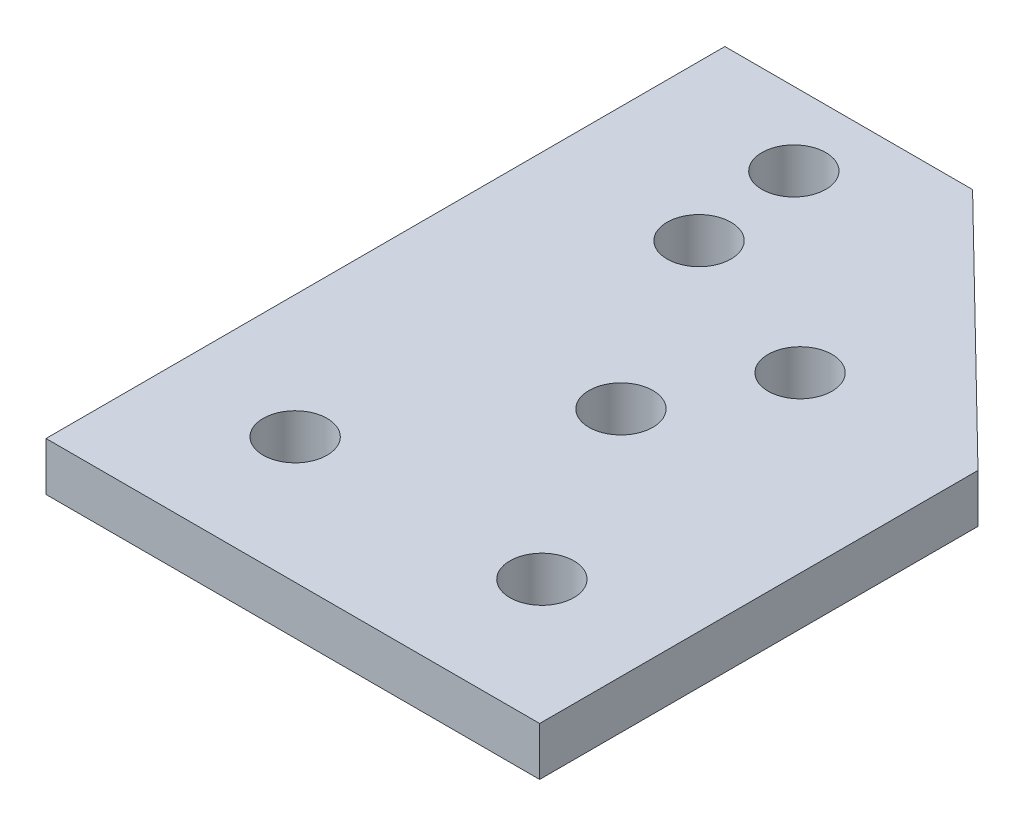
ISO-10303-21;
HEADER;
FILE_DESCRIPTION(('STEP AP214'),'2;1');
FILE_NAME('part.step','',(''),(''),'','','');
FILE_SCHEMA(('AUTOMOTIVE_DESIGN { 1 0 10303 214 1 1 1 1 }'));
ENDSEC;
DATA;
#1=APPLICATION_CONTEXT('core data for automotive mechanical design processes');
#2=APPLICATION_PROTOCOL_DEFINITION('international standard','automotive_design',2000,#1);
#3=PRODUCT_CONTEXT('',#1,'mechanical');
#4=PRODUCT('Part','Part','',(#3));
#5=PRODUCT_RELATED_PRODUCT_CATEGORY('part','',(#4));
#6=PRODUCT_DEFINITION_FORMATION('','',#4);
#7=PRODUCT_DEFINITION_CONTEXT('part definition',#1,'design');
#8=PRODUCT_DEFINITION('design','',#6,#7);
#9=PRODUCT_DEFINITION_SHAPE('','',#8);
#10=(LENGTH_UNIT() NAMED_UNIT(*) SI_UNIT(.MILLI.,.METRE.));
#11=(NAMED_UNIT(*) PLANE_ANGLE_UNIT() SI_UNIT($,.RADIAN.));
#12=(NAMED_UNIT(*) SI_UNIT($,.STERADIAN.) SOLID_ANGLE_UNIT());
#13=UNCERTAINTY_MEASURE_WITH_UNIT(LENGTH_MEASURE(1.E-05),#10,'distance_accuracy_value','');
#14=(GEOMETRIC_REPRESENTATION_CONTEXT(3) GLOBAL_UNCERTAINTY_ASSIGNED_CONTEXT((#13)) GLOBAL_UNIT_ASSIGNED_CONTEXT((#10,
#11,#12)) REPRESENTATION_CONTEXT('',''));
#15=CARTESIAN_POINT('',(0.,0.,0.));
#16=DIRECTION('',(0.,0.,1.));
#17=DIRECTION('',(1.,0.,0.));
#18=AXIS2_PLACEMENT_3D('',#15,#16,#17);
#19=CARTESIAN_POINT('',(0.,5.,0.));
#20=DIRECTION('',(0.,0.,1.));
#21=DIRECTION('',(1.,0.,0.));
#22=AXIS2_PLACEMENT_3D('',#19,#20,#21);
#23=PLANE('',#22);
#24=DIRECTION('',(-1.,0.,0.));
#25=VECTOR('',#24,1.);
#26=CARTESIAN_POINT('',(0.,0.,0.));
#27=LINE('',#26,#25);
#28=CARTESIAN_POINT('',(50.9,0.,0.));
#29=VERTEX_POINT('',#28);
#30=CARTESIAN_POINT('',(0.,0.,0.));
#31=VERTEX_POINT('',#30);
#32=EDGE_CURVE('E125',#29,#31,#27,.T.);
#33=ORIENTED_EDGE('',*,*,#32,.F.);
#34=DIRECTION('',(0.,-1.,0.));
#35=VECTOR('',#34,1.);
#36=CARTESIAN_POINT('',(50.9,5.,0.));
#37=LINE('',#36,#35);
#38=CARTESIAN_POINT('',(50.9,5.,0.));
#39=VERTEX_POINT('',#38);
#40=EDGE_CURVE('E11',#39,#29,#37,.T.);
#41=ORIENTED_EDGE('',*,*,#40,.F.);
#42=DIRECTION('',(-1.,0.,0.));
#43=VECTOR('',#42,1.);
#44=CARTESIAN_POINT('',(0.,5.,0.));
#45=LINE('',#44,#43);
#46=CARTESIAN_POINT('',(0.,5.,0.));
#47=VERTEX_POINT('',#46);
#48=EDGE_CURVE('E296',#39,#47,#45,.T.);
#49=ORIENTED_EDGE('',*,*,#48,.T.);
#50=DIRECTION('',(0.,-1.,0.));
#51=VECTOR('',#50,1.);
#52=CARTESIAN_POINT('',(0.,5.,0.));
#53=LINE('',#52,#51);
#54=EDGE_CURVE('E50',#47,#31,#53,.T.);
#55=ORIENTED_EDGE('',*,*,#54,.T.);
#56=EDGE_LOOP('',(#33,#41,#49,#55));
#57=FACE_BOUND('',#56,.T.);
#58=ADVANCED_FACE('F33',(#57),#23,.T.);
#59=CARTESIAN_POINT('',(50.9,5.,0.));
#60=DIRECTION('',(1.,0.,0.));
#61=DIRECTION('',(0.,0.,-1.));
#62=AXIS2_PLACEMENT_3D('',#59,#60,#61);
#63=PLANE('',#62);
#64=DIRECTION('',(0.,0.,1.));
#65=VECTOR('',#64,1.);
#66=CARTESIAN_POINT('',(50.9,0.,0.));
#67=LINE('',#66,#65);
#68=CARTESIAN_POINT('',(50.9,0.,-45.2));
#69=VERTEX_POINT('',#68);
#70=EDGE_CURVE('E127',#69,#29,#67,.T.);
#71=ORIENTED_EDGE('',*,*,#70,.F.);
#72=DIRECTION('',(0.,-1.,0.));
#73=VECTOR('',#72,1.);
#74=CARTESIAN_POINT('',(50.9,5.,-45.2));
#75=LINE('',#74,#73);
#76=CARTESIAN_POINT('',(50.9,5.,-45.2));
#77=VERTEX_POINT('',#76);
#78=EDGE_CURVE('E42',#77,#69,#75,.T.);
#79=ORIENTED_EDGE('',*,*,#78,.F.);
#80=DIRECTION('',(0.,0.,1.));
#81=VECTOR('',#80,1.);
#82=CARTESIAN_POINT('',(50.9,5.,0.));
#83=LINE('',#82,#81);
#84=EDGE_CURVE('E99',#77,#39,#83,.T.);
#85=ORIENTED_EDGE('',*,*,#84,.T.);
#86=ORIENTED_EDGE('',*,*,#40,.T.);
#87=EDGE_LOOP('',(#71,#79,#85,#86));
#88=FACE_BOUND('',#87,.T.);
#89=ADVANCED_FACE('F140',(#88),#63,.T.);
#90=CARTESIAN_POINT('',(47.4761761848323,5.,-48.5482188728769));
#91=DIRECTION('',(0.699168875902642,0.,-0.714956560197217));
#92=DIRECTION('',(-0.714956560197217,0.,-0.699168875902642));
#93=AXIS2_PLACEMENT_3D('',#90,#91,#92);
#94=PLANE('',#93);
#95=DIRECTION('',(0.714956560197217,0.,0.699168875902642));
#96=VECTOR('',#95,1.);
#97=CARTESIAN_POINT('',(47.4761761848323,0.,-48.5482188728769));
#98=LINE('',#97,#96);
#99=CARTESIAN_POINT('',(25.54,0.,-70.));
#100=VERTEX_POINT('',#99);
#101=EDGE_CURVE('E87',#100,#69,#98,.T.);
#102=ORIENTED_EDGE('',*,*,#101,.F.);
#103=DIRECTION('',(0.,-1.,0.));
#104=VECTOR('',#103,1.);
#105=CARTESIAN_POINT('',(25.54,5.,-70.));
#106=LINE('',#105,#104);
#107=CARTESIAN_POINT('',(25.54,5.,-70.));
#108=VERTEX_POINT('',#107);
#109=EDGE_CURVE('E82',#108,#100,#106,.T.);
#110=ORIENTED_EDGE('',*,*,#109,.F.);
#111=DIRECTION('',(0.714956560197217,0.,0.699168875902642));
#112=VECTOR('',#111,1.);
#113=CARTESIAN_POINT('',(47.4761761848323,5.,-48.5482188728769));
#114=LINE('',#113,#112);
#115=EDGE_CURVE('E85',#108,#77,#114,.T.);
#116=ORIENTED_EDGE('',*,*,#115,.T.);
#117=ORIENTED_EDGE('',*,*,#78,.T.);
#118=EDGE_LOOP('',(#102,#110,#116,#117));
#119=FACE_BOUND('',#118,.T.);
#120=ADVANCED_FACE('F84',(#119),#94,.T.);
#121=CARTESIAN_POINT('',(0.,5.,-70.));
#122=DIRECTION('',(0.,0.,-1.));
#123=DIRECTION('',(-1.,0.,0.));
#124=AXIS2_PLACEMENT_3D('',#121,#122,#123);
#125=PLANE('',#124);
#126=DIRECTION('',(1.,0.,0.));
#127=VECTOR('',#126,1.);
#128=CARTESIAN_POINT('',(0.,0.,-70.));
#129=LINE('',#128,#127);
#130=CARTESIAN_POINT('',(0.,0.,-70.));
#131=VERTEX_POINT('',#130);
#132=EDGE_CURVE('E131',#131,#100,#129,.T.);
#133=ORIENTED_EDGE('',*,*,#132,.F.);
#134=DIRECTION('',(0.,-1.,0.));
#135=VECTOR('',#134,1.);
#136=CARTESIAN_POINT('',(0.,5.,-70.));
#137=LINE('',#136,#135);
#138=CARTESIAN_POINT('',(0.,5.,-70.));
#139=VERTEX_POINT('',#138);
#140=EDGE_CURVE('E66',#139,#131,#137,.T.);
#141=ORIENTED_EDGE('',*,*,#140,.F.);
#142=DIRECTION('',(1.,0.,0.));
#143=VECTOR('',#142,1.);
#144=CARTESIAN_POINT('',(0.,5.,-70.));
#145=LINE('',#144,#143);
#146=EDGE_CURVE('E97',#139,#108,#145,.T.);
#147=ORIENTED_EDGE('',*,*,#146,.T.);
#148=ORIENTED_EDGE('',*,*,#109,.T.);
#149=EDGE_LOOP('',(#133,#141,#147,#148));
#150=FACE_BOUND('',#149,.T.);
#151=ADVANCED_FACE('F101',(#150),#125,.T.);
#152=CARTESIAN_POINT('',(14.6674832347224,5.,-62.445));
#153=DIRECTION('',(0.,-1.,0.));
#154=DIRECTION('',(0.,0.,-1.));
#155=AXIS2_PLACEMENT_3D('',#152,#153,#154);
#156=CYLINDRICAL_SURFACE('',#155,3.295);
#157=CARTESIAN_POINT('',(14.6674832347224,5.,-62.445));
#158=DIRECTION('',(0.,1.,0.));
#159=DIRECTION('',(0.,0.,1.));
#160=AXIS2_PLACEMENT_3D('',#157,#158,#159);
#161=CIRCLE('',#160,3.295);
#162=CARTESIAN_POINT('',(14.6674832347224,5.,-59.15));
#163=VERTEX_POINT('',#162);
#164=EDGE_CURVE('E293',#163,#163,#161,.T.);
#165=ORIENTED_EDGE('',*,*,#164,.T.);
#166=EDGE_LOOP('',(#165));
#167=FACE_BOUND('',#166,.T.);
#168=CARTESIAN_POINT('',(14.6674832347224,0.,-62.445));
#169=DIRECTION('',(0.,1.,0.));
#170=DIRECTION('',(0.,0.,1.));
#171=AXIS2_PLACEMENT_3D('',#168,#169,#170);
#172=CIRCLE('',#171,3.295);
#173=CARTESIAN_POINT('',(14.6674832347224,0.,-59.15));
#174=VERTEX_POINT('',#173);
#175=EDGE_CURVE('E122',#174,#174,#172,.T.);
#176=ORIENTED_EDGE('',*,*,#175,.F.);
#177=EDGE_LOOP('',(#176));
#178=FACE_BOUND('',#177,.T.);
#179=ADVANCED_FACE('F164',(#167,#178),#156,.F.);
#180=CARTESIAN_POINT('',(33.0089447644355,5.,-44.7438449824862));
#181=DIRECTION('',(0.,-1.,0.));
#182=DIRECTION('',(0.,0.,-1.));
#183=AXIS2_PLACEMENT_3D('',#180,#181,#182);
#184=CYLINDRICAL_SURFACE('',#183,3.295);
#185=CARTESIAN_POINT('',(33.0089447644355,5.,-44.7438449824862));
#186=DIRECTION('',(0.,1.,0.));
#187=DIRECTION('',(0.,0.,1.));
#188=AXIS2_PLACEMENT_3D('',#185,#186,#187);
#189=CIRCLE('',#188,3.295);
#190=CARTESIAN_POINT('',(33.0089447644355,5.,-41.4488449824862));
#191=VERTEX_POINT('',#190);
#192=EDGE_CURVE('E290',#191,#191,#189,.T.);
#193=ORIENTED_EDGE('',*,*,#192,.T.);
#194=EDGE_LOOP('',(#193));
#195=FACE_BOUND('',#194,.T.);
#196=CARTESIAN_POINT('',(33.0089447644355,0.,-44.7438449824862));
#197=DIRECTION('',(0.,1.,0.));
#198=DIRECTION('',(0.,0.,1.));
#199=AXIS2_PLACEMENT_3D('',#196,#197,#198);
#200=CIRCLE('',#199,3.295);
#201=CARTESIAN_POINT('',(33.0089447644355,0.,-41.4488449824862));
#202=VERTEX_POINT('',#201);
#203=EDGE_CURVE('E119',#202,#202,#200,.T.);
#204=ORIENTED_EDGE('',*,*,#203,.F.);
#205=EDGE_LOOP('',(#204));
#206=FACE_BOUND('',#205,.T.);
#207=ADVANCED_FACE('F167',(#195,#206),#184,.F.);
#208=CARTESIAN_POINT('',(12.695,5.,-12.995));
#209=DIRECTION('',(0.,-1.,0.));
#210=DIRECTION('',(0.,0.,-1.));
#211=AXIS2_PLACEMENT_3D('',#208,#209,#210);
#212=CYLINDRICAL_SURFACE('',#211,3.295);
#213=CARTESIAN_POINT('',(12.695,5.,-12.995));
#214=DIRECTION('',(0.,1.,0.));
#215=DIRECTION('',(0.,0.,1.));
#216=AXIS2_PLACEMENT_3D('',#213,#214,#215);
#217=CIRCLE('',#216,3.295);
#218=CARTESIAN_POINT('',(12.695,5.,-9.69999999999999));
#219=VERTEX_POINT('',#218);
#220=EDGE_CURVE('E283',#219,#219,#217,.T.);
#221=ORIENTED_EDGE('',*,*,#220,.T.);
#222=EDGE_LOOP('',(#221));
#223=FACE_BOUND('',#222,.T.);
#224=CARTESIAN_POINT('',(12.695,0.,-12.995));
#225=DIRECTION('',(0.,1.,0.));
#226=DIRECTION('',(0.,0.,1.));
#227=AXIS2_PLACEMENT_3D('',#224,#225,#226);
#228=CIRCLE('',#227,3.295);
#229=CARTESIAN_POINT('',(12.695,0.,-9.69999999999999));
#230=VERTEX_POINT('',#229);
#231=EDGE_CURVE('E116',#230,#230,#228,.T.);
#232=ORIENTED_EDGE('',*,*,#231,.F.);
#233=EDGE_LOOP('',(#232));
#234=FACE_BOUND('',#233,.T.);
#235=ADVANCED_FACE('F171',(#223,#234),#212,.F.);
#236=CARTESIAN_POINT('',(38.135,5.,-12.995));
#237=DIRECTION('',(0.,-1.,0.));
#238=DIRECTION('',(0.,0.,-1.));
#239=AXIS2_PLACEMENT_3D('',#236,#237,#238);
#240=CYLINDRICAL_SURFACE('',#239,3.295);
#241=CARTESIAN_POINT('',(38.135,5.,-12.995));
#242=DIRECTION('',(0.,1.,0.));
#243=DIRECTION('',(0.,0.,1.));
#244=AXIS2_PLACEMENT_3D('',#241,#242,#243);
#245=CIRCLE('',#244,3.295);
#246=CARTESIAN_POINT('',(38.135,5.,-9.69999999999999));
#247=VERTEX_POINT('',#246);
#248=EDGE_CURVE('E280',#247,#247,#245,.T.);
#249=ORIENTED_EDGE('',*,*,#248,.T.);
#250=EDGE_LOOP('',(#249));
#251=FACE_BOUND('',#250,.T.);
#252=CARTESIAN_POINT('',(38.135,0.,-12.995));
#253=DIRECTION('',(0.,1.,0.));
#254=DIRECTION('',(0.,0.,1.));
#255=AXIS2_PLACEMENT_3D('',#252,#253,#254);
#256=CIRCLE('',#255,3.295);
#257=CARTESIAN_POINT('',(38.135,0.,-9.69999999999999));
#258=VERTEX_POINT('',#257);
#259=EDGE_CURVE('E113',#258,#258,#256,.T.);
#260=ORIENTED_EDGE('',*,*,#259,.F.);
#261=EDGE_LOOP('',(#260));
#262=FACE_BOUND('',#261,.T.);
#263=ADVANCED_FACE('F175',(#251,#262),#240,.F.);
#264=CARTESIAN_POINT('',(16.,5.,-51.3339446255367));
#265=DIRECTION('',(0.,-1.,0.));
#266=DIRECTION('',(0.,0.,-1.));
#267=AXIS2_PLACEMENT_3D('',#264,#265,#266);
#268=CYLINDRICAL_SURFACE('',#267,3.29499999999999);
#269=CARTESIAN_POINT('',(16.,5.,-51.3339446255367));
#270=DIRECTION('',(0.,1.,0.));
#271=DIRECTION('',(0.,0.,1.));
#272=AXIS2_PLACEMENT_3D('',#269,#270,#271);
#273=CIRCLE('',#272,3.29499999999999);
#274=CARTESIAN_POINT('',(16.,5.,-48.0389446255367));
#275=VERTEX_POINT('',#274);
#276=EDGE_CURVE('E186',#275,#275,#273,.T.);
#277=ORIENTED_EDGE('',*,*,#276,.T.);
#278=EDGE_LOOP('',(#277));
#279=FACE_BOUND('',#278,.T.);
#280=CARTESIAN_POINT('',(16.,0.,-51.3339446255367));
#281=DIRECTION('',(0.,1.,0.));
#282=DIRECTION('',(0.,0.,1.));
#283=AXIS2_PLACEMENT_3D('',#280,#281,#282);
#284=CIRCLE('',#283,3.29499999999999);
#285=CARTESIAN_POINT('',(16.,0.,-48.0389446255367));
#286=VERTEX_POINT('',#285);
#287=EDGE_CURVE('E110',#286,#286,#284,.T.);
#288=ORIENTED_EDGE('',*,*,#287,.F.);
#289=EDGE_LOOP('',(#288));
#290=FACE_BOUND('',#289,.T.);
#291=ADVANCED_FACE('F152',(#279,#290),#268,.F.);
#292=CARTESIAN_POINT('',(27.,5.,-32.2813857422792));
#293=DIRECTION('',(0.,-1.,0.));
#294=DIRECTION('',(0.,0.,-1.));
#295=AXIS2_PLACEMENT_3D('',#292,#293,#294);
#296=CYLINDRICAL_SURFACE('',#295,3.29499999999997);
#297=CARTESIAN_POINT('',(27.,5.,-32.2813857422792));
#298=DIRECTION('',(0.,1.,0.));
#299=DIRECTION('',(0.,0.,1.));
#300=AXIS2_PLACEMENT_3D('',#297,#298,#299);
#301=CIRCLE('',#300,3.29499999999997);
#302=CARTESIAN_POINT('',(27.,5.,-28.9863857422793));
#303=VERTEX_POINT('',#302);
#304=EDGE_CURVE('E136',#303,#303,#301,.T.);
#305=ORIENTED_EDGE('',*,*,#304,.T.);
#306=EDGE_LOOP('',(#305));
#307=FACE_BOUND('',#306,.T.);
#308=CARTESIAN_POINT('',(27.,0.,-32.2813857422792));
#309=DIRECTION('',(0.,1.,0.));
#310=DIRECTION('',(0.,0.,1.));
#311=AXIS2_PLACEMENT_3D('',#308,#309,#310);
#312=CIRCLE('',#311,3.29499999999997);
#313=CARTESIAN_POINT('',(27.,0.,-28.9863857422793));
#314=VERTEX_POINT('',#313);
#315=EDGE_CURVE('E107',#314,#314,#312,.T.);
#316=ORIENTED_EDGE('',*,*,#315,.F.);
#317=EDGE_LOOP('',(#316));
#318=FACE_BOUND('',#317,.T.);
#319=ADVANCED_FACE('F35',(#307,#318),#296,.F.);
#320=CARTESIAN_POINT('',(0.,5.,0.));
#321=DIRECTION('',(-1.,0.,0.));
#322=DIRECTION('',(0.,0.,1.));
#323=AXIS2_PLACEMENT_3D('',#320,#321,#322);
#324=PLANE('',#323);
#325=DIRECTION('',(0.,0.,-1.));
#326=VECTOR('',#325,1.);
#327=CARTESIAN_POINT('',(0.,0.,0.));
#328=LINE('',#327,#326);
#329=EDGE_CURVE('E133',#31,#131,#328,.T.);
#330=ORIENTED_EDGE('',*,*,#329,.F.);
#331=ORIENTED_EDGE('',*,*,#54,.F.);
#332=DIRECTION('',(0.,0.,-1.));
#333=VECTOR('',#332,1.);
#334=CARTESIAN_POINT('',(0.,5.,0.));
#335=LINE('',#334,#333);
#336=EDGE_CURVE('E102',#47,#139,#335,.T.);
#337=ORIENTED_EDGE('',*,*,#336,.T.);
#338=ORIENTED_EDGE('',*,*,#140,.T.);
#339=EDGE_LOOP('',(#330,#331,#337,#338));
#340=FACE_BOUND('',#339,.T.);
#341=ADVANCED_FACE('F143',(#340),#324,.T.);
#342=CARTESIAN_POINT('',(0.,5.,0.));
#343=DIRECTION('',(0.,1.,0.));
#344=DIRECTION('',(0.,0.,1.));
#345=AXIS2_PLACEMENT_3D('',#342,#343,#344);
#346=PLANE('',#345);
#347=ORIENTED_EDGE('',*,*,#304,.F.);
#348=EDGE_LOOP('',(#347));
#349=FACE_BOUND('',#348,.T.);
#350=ORIENTED_EDGE('',*,*,#276,.F.);
#351=EDGE_LOOP('',(#350));
#352=FACE_BOUND('',#351,.T.);
#353=ORIENTED_EDGE('',*,*,#248,.F.);
#354=EDGE_LOOP('',(#353));
#355=FACE_BOUND('',#354,.T.);
#356=ORIENTED_EDGE('',*,*,#220,.F.);
#357=EDGE_LOOP('',(#356));
#358=FACE_BOUND('',#357,.T.);
#359=ORIENTED_EDGE('',*,*,#192,.F.);
#360=EDGE_LOOP('',(#359));
#361=FACE_BOUND('',#360,.T.);
#362=ORIENTED_EDGE('',*,*,#164,.F.);
#363=EDGE_LOOP('',(#362));
#364=FACE_BOUND('',#363,.T.);
#365=ORIENTED_EDGE('',*,*,#48,.F.);
#366=ORIENTED_EDGE('',*,*,#84,.F.);
#367=ORIENTED_EDGE('',*,*,#115,.F.);
#368=ORIENTED_EDGE('',*,*,#146,.F.);
#369=ORIENTED_EDGE('',*,*,#336,.F.);
#370=EDGE_LOOP('',(#365,#366,#367,#368,#369));
#371=FACE_BOUND('',#370,.T.);
#372=ADVANCED_FACE('F95',(#349,#352,#355,#358,#361,#364,#371),#346,.T.);
#373=CARTESIAN_POINT('',(0.,0.,0.));
#374=DIRECTION('',(0.,1.,0.));
#375=DIRECTION('',(0.,0.,1.));
#376=AXIS2_PLACEMENT_3D('',#373,#374,#375);
#377=PLANE('',#376);
#378=ORIENTED_EDGE('',*,*,#315,.T.);
#379=EDGE_LOOP('',(#378));
#380=FACE_BOUND('',#379,.T.);
#381=ORIENTED_EDGE('',*,*,#287,.T.);
#382=EDGE_LOOP('',(#381));
#383=FACE_BOUND('',#382,.T.);
#384=ORIENTED_EDGE('',*,*,#259,.T.);
#385=EDGE_LOOP('',(#384));
#386=FACE_BOUND('',#385,.T.);
#387=ORIENTED_EDGE('',*,*,#231,.T.);
#388=EDGE_LOOP('',(#387));
#389=FACE_BOUND('',#388,.T.);
#390=ORIENTED_EDGE('',*,*,#203,.T.);
#391=EDGE_LOOP('',(#390));
#392=FACE_BOUND('',#391,.T.);
#393=ORIENTED_EDGE('',*,*,#175,.T.);
#394=EDGE_LOOP('',(#393));
#395=FACE_BOUND('',#394,.T.);
#396=ORIENTED_EDGE('',*,*,#32,.T.);
#397=ORIENTED_EDGE('',*,*,#329,.T.);
#398=ORIENTED_EDGE('',*,*,#132,.T.);
#399=ORIENTED_EDGE('',*,*,#101,.T.);
#400=ORIENTED_EDGE('',*,*,#70,.T.);
#401=EDGE_LOOP('',(#396,#397,#398,#399,#400));
#402=FACE_BOUND('',#401,.T.);
#403=ADVANCED_FACE('F142',(#380,#383,#386,#389,#392,#395,#402),#377,.F.);
#404=CLOSED_SHELL('',(#58,#89,#120,#151,#179,#207,#235,#263,#291,#319,#341,#372,#403));
#405=MANIFOLD_SOLID_BREP('B2',#404);
#406=ADVANCED_BREP_SHAPE_REPRESENTATION('',(#18,#405),#14);
#407=SHAPE_DEFINITION_REPRESENTATION(#9,#406);
ENDSEC;
END-ISO-10303-21;
